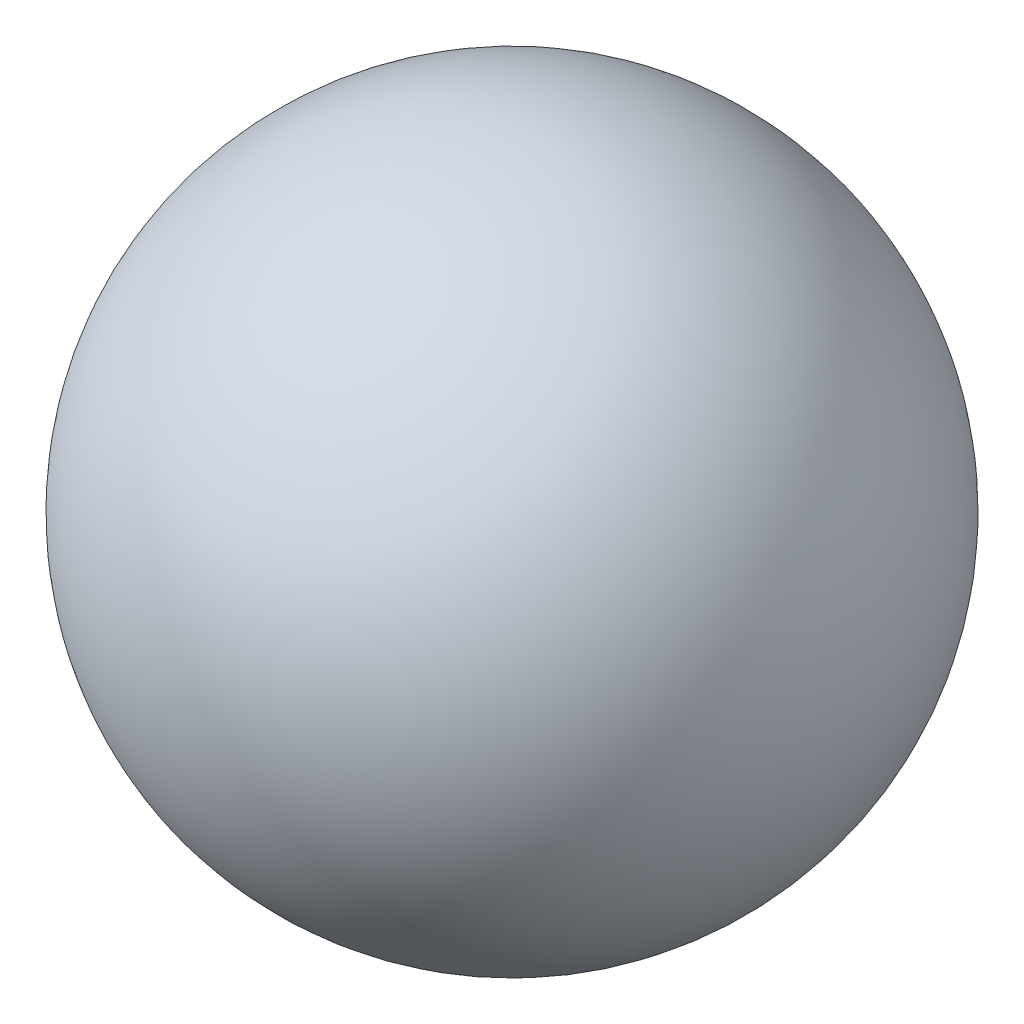
ISO-10303-21;
HEADER;
FILE_DESCRIPTION(('STEP AP214'),'2;1');
FILE_NAME('part.step','',(''),(''),'','','');
FILE_SCHEMA(('AUTOMOTIVE_DESIGN { 1 0 10303 214 1 1 1 1 }'));
ENDSEC;
DATA;
#1=APPLICATION_CONTEXT('core data for automotive mechanical design processes');
#2=APPLICATION_PROTOCOL_DEFINITION('international standard','automotive_design',2000,#1);
#3=PRODUCT_CONTEXT('',#1,'mechanical');
#4=PRODUCT('Part','Part','',(#3));
#5=PRODUCT_RELATED_PRODUCT_CATEGORY('part','',(#4));
#6=PRODUCT_DEFINITION_FORMATION('','',#4);
#7=PRODUCT_DEFINITION_CONTEXT('part definition',#1,'design');
#8=PRODUCT_DEFINITION('design','',#6,#7);
#9=PRODUCT_DEFINITION_SHAPE('','',#8);
#10=(LENGTH_UNIT() NAMED_UNIT(*) SI_UNIT(.MILLI.,.METRE.));
#11=(NAMED_UNIT(*) PLANE_ANGLE_UNIT() SI_UNIT($,.RADIAN.));
#12=(NAMED_UNIT(*) SI_UNIT($,.STERADIAN.) SOLID_ANGLE_UNIT());
#13=UNCERTAINTY_MEASURE_WITH_UNIT(LENGTH_MEASURE(1.E-05),#10,'distance_accuracy_value','');
#14=(GEOMETRIC_REPRESENTATION_CONTEXT(3) GLOBAL_UNCERTAINTY_ASSIGNED_CONTEXT((#13)) GLOBAL_UNIT_ASSIGNED_CONTEXT((#10,
#11,#12)) REPRESENTATION_CONTEXT('',''));
#15=CARTESIAN_POINT('',(0.,0.,0.));
#16=DIRECTION('',(0.,0.,1.));
#17=DIRECTION('',(1.,0.,0.));
#18=AXIS2_PLACEMENT_3D('',#15,#16,#17);
#19=CARTESIAN_POINT('',(-10.6881759454156,-2.,4.88112640277217));
#20=DIRECTION('',(0.,0.,1.));
#21=DIRECTION('',(1.,0.,0.));
#22=AXIS2_PLACEMENT_3D('',#19,#20,#21);
#23=SPHERICAL_SURFACE('',#22,1.05);
#24=CARTESIAN_POINT('',(-10.6881759454156,-2.,5.93112640277217));
#25=VERTEX_POINT('',#24);
#26=VERTEX_LOOP('',#25);
#27=FACE_BOUND('',#26,.T.);
#28=ADVANCED_FACE('F12',(#27),#23,.T.);
#29=CLOSED_SHELL('',(#28));
#30=MANIFOLD_SOLID_BREP('B1',#29);
#31=ADVANCED_BREP_SHAPE_REPRESENTATION('',(#18,#30),#14);
#32=SHAPE_DEFINITION_REPRESENTATION(#9,#31);
ENDSEC;
END-ISO-10303-21;
